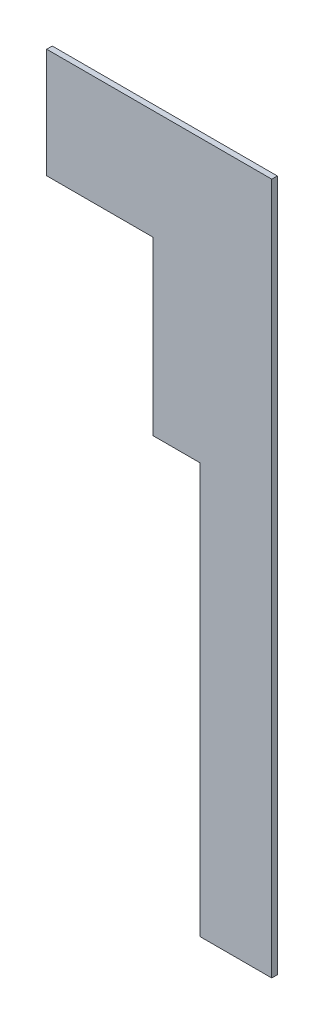
ISO-10303-21;
HEADER;
FILE_DESCRIPTION(('STEP AP214'),'2;1');
FILE_NAME('part.step','',(''),(''),'','','');
FILE_SCHEMA(('AUTOMOTIVE_DESIGN { 1 0 10303 214 1 1 1 1 }'));
ENDSEC;
DATA;
#1=APPLICATION_CONTEXT('core data for automotive mechanical design processes');
#2=APPLICATION_PROTOCOL_DEFINITION('international standard','automotive_design',2000,#1);
#3=PRODUCT_CONTEXT('',#1,'mechanical');
#4=PRODUCT('Part','Part','',(#3));
#5=PRODUCT_RELATED_PRODUCT_CATEGORY('part','',(#4));
#6=PRODUCT_DEFINITION_FORMATION('','',#4);
#7=PRODUCT_DEFINITION_CONTEXT('part definition',#1,'design');
#8=PRODUCT_DEFINITION('design','',#6,#7);
#9=PRODUCT_DEFINITION_SHAPE('','',#8);
#10=(LENGTH_UNIT() NAMED_UNIT(*) SI_UNIT(.MILLI.,.METRE.));
#11=(NAMED_UNIT(*) PLANE_ANGLE_UNIT() SI_UNIT($,.RADIAN.));
#12=(NAMED_UNIT(*) SI_UNIT($,.STERADIAN.) SOLID_ANGLE_UNIT());
#13=UNCERTAINTY_MEASURE_WITH_UNIT(LENGTH_MEASURE(1.E-05),#10,'distance_accuracy_value','');
#14=(GEOMETRIC_REPRESENTATION_CONTEXT(3) GLOBAL_UNCERTAINTY_ASSIGNED_CONTEXT((#13)) GLOBAL_UNIT_ASSIGNED_CONTEXT((#10,
#11,#12)) REPRESENTATION_CONTEXT('',''));
#15=CARTESIAN_POINT('',(0.,0.,0.));
#16=DIRECTION('',(0.,0.,1.));
#17=DIRECTION('',(1.,0.,0.));
#18=AXIS2_PLACEMENT_3D('',#15,#16,#17);
#19=CARTESIAN_POINT('',(0.,0.,-30.));
#20=DIRECTION('',(0.,0.,-1.));
#21=DIRECTION('',(-1.,0.,0.));
#22=AXIS2_PLACEMENT_3D('',#19,#20,#21);
#23=PLANE('',#22);
#24=DIRECTION('',(0.,-1.,0.));
#25=VECTOR('',#24,1.);
#26=CARTESIAN_POINT('',(1372.,1.21372588827547E-13,-30.));
#27=LINE('',#26,#25);
#28=CARTESIAN_POINT('',(1372.,4420.,-30.));
#29=VERTEX_POINT('',#28);
#30=CARTESIAN_POINT('',(1372.,3495.,-30.));
#31=VERTEX_POINT('',#30);
#32=EDGE_CURVE('E107',#29,#31,#27,.T.);
#33=ORIENTED_EDGE('',*,*,#32,.F.);
#34=DIRECTION('',(-1.,0.,0.));
#35=VECTOR('',#34,1.);
#36=CARTESIAN_POINT('',(0.,4420.,-30.));
#37=LINE('',#36,#35);
#38=CARTESIAN_POINT('',(800.,4420.,-30.));
#39=VERTEX_POINT('',#38);
#40=EDGE_CURVE('E110',#29,#39,#37,.T.);
#41=ORIENTED_EDGE('',*,*,#40,.T.);
#42=DIRECTION('',(0.,1.,0.));
#43=VECTOR('',#42,1.);
#44=CARTESIAN_POINT('',(800.,1465.84471612931,-30.));
#45=LINE('',#44,#43);
#46=CARTESIAN_POINT('',(800.,5010.,-30.));
#47=VERTEX_POINT('',#46);
#48=EDGE_CURVE('E154',#39,#47,#45,.T.);
#49=ORIENTED_EDGE('',*,*,#48,.T.);
#50=DIRECTION('',(1.,0.,0.));
#51=VECTOR('',#50,1.);
#52=CARTESIAN_POINT('',(520.,5010.,-30.));
#53=LINE('',#52,#51);
#54=CARTESIAN_POINT('',(2011.,5010.,-30.));
#55=VERTEX_POINT('',#54);
#56=EDGE_CURVE('E159',#47,#55,#53,.T.);
#57=ORIENTED_EDGE('',*,*,#56,.T.);
#58=DIRECTION('',(0.,1.,0.));
#59=VECTOR('',#58,1.);
#60=CARTESIAN_POINT('',(2011.,6025.,-30.));
#61=LINE('',#60,#59);
#62=CARTESIAN_POINT('',(2011.,1287.,-30.));
#63=VERTEX_POINT('',#62);
#64=EDGE_CURVE('E46',#63,#55,#61,.T.);
#65=ORIENTED_EDGE('',*,*,#64,.F.);
#66=DIRECTION('',(-1.,0.,0.));
#67=VECTOR('',#66,1.);
#68=CARTESIAN_POINT('',(2011.,1287.,-30.));
#69=LINE('',#68,#67);
#70=CARTESIAN_POINT('',(1626.,1287.,-30.));
#71=VERTEX_POINT('',#70);
#72=EDGE_CURVE('E128',#63,#71,#69,.T.);
#73=ORIENTED_EDGE('',*,*,#72,.T.);
#74=DIRECTION('',(0.,1.,0.));
#75=VECTOR('',#74,1.);
#76=CARTESIAN_POINT('',(1626.,0.,-30.));
#77=LINE('',#76,#75);
#78=CARTESIAN_POINT('',(1626.,3495.,-30.));
#79=VERTEX_POINT('',#78);
#80=EDGE_CURVE('E139',#71,#79,#77,.T.);
#81=ORIENTED_EDGE('',*,*,#80,.T.);
#82=DIRECTION('',(1.,0.,0.));
#83=VECTOR('',#82,1.);
#84=CARTESIAN_POINT('',(0.,3495.,-30.));
#85=LINE('',#84,#83);
#86=EDGE_CURVE('E113',#31,#79,#85,.T.);
#87=ORIENTED_EDGE('',*,*,#86,.F.);
#88=EDGE_LOOP('',(#33,#41,#49,#57,#65,#73,#81,#87));
#89=FACE_BOUND('',#88,.T.);
#90=ADVANCED_FACE('F38',(#89),#23,.T.);
#91=CARTESIAN_POINT('',(0.,0.,0.));
#92=DIRECTION('',(0.,0.,-1.));
#93=DIRECTION('',(-1.,0.,0.));
#94=AXIS2_PLACEMENT_3D('',#91,#92,#93);
#95=PLANE('',#94);
#96=DIRECTION('',(1.,0.,0.));
#97=VECTOR('',#96,1.);
#98=CARTESIAN_POINT('',(0.,4420.,0.));
#99=LINE('',#98,#97);
#100=CARTESIAN_POINT('',(800.,4420.,0.));
#101=VERTEX_POINT('',#100);
#102=CARTESIAN_POINT('',(1372.,4420.,0.));
#103=VERTEX_POINT('',#102);
#104=EDGE_CURVE('E116',#101,#103,#99,.T.);
#105=ORIENTED_EDGE('',*,*,#104,.T.);
#106=DIRECTION('',(0.,1.,0.));
#107=VECTOR('',#106,1.);
#108=CARTESIAN_POINT('',(1372.,1.21372588827547E-13,0.));
#109=LINE('',#108,#107);
#110=CARTESIAN_POINT('',(1372.,3495.,0.));
#111=VERTEX_POINT('',#110);
#112=EDGE_CURVE('E115',#111,#103,#109,.T.);
#113=ORIENTED_EDGE('',*,*,#112,.F.);
#114=DIRECTION('',(-1.,0.,0.));
#115=VECTOR('',#114,1.);
#116=CARTESIAN_POINT('',(0.,3495.,0.));
#117=LINE('',#116,#115);
#118=CARTESIAN_POINT('',(1626.,3495.,0.));
#119=VERTEX_POINT('',#118);
#120=EDGE_CURVE('E53',#119,#111,#117,.T.);
#121=ORIENTED_EDGE('',*,*,#120,.F.);
#122=DIRECTION('',(0.,-1.,0.));
#123=VECTOR('',#122,1.);
#124=CARTESIAN_POINT('',(1626.,0.,0.));
#125=LINE('',#124,#123);
#126=CARTESIAN_POINT('',(1626.,1287.,0.));
#127=VERTEX_POINT('',#126);
#128=EDGE_CURVE('E11',#119,#127,#125,.T.);
#129=ORIENTED_EDGE('',*,*,#128,.T.);
#130=DIRECTION('',(1.,0.,0.));
#131=VECTOR('',#130,1.);
#132=CARTESIAN_POINT('',(0.,1287.,0.));
#133=LINE('',#132,#131);
#134=CARTESIAN_POINT('',(2011.,1287.,0.));
#135=VERTEX_POINT('',#134);
#136=EDGE_CURVE('E147',#127,#135,#133,.T.);
#137=ORIENTED_EDGE('',*,*,#136,.T.);
#138=DIRECTION('',(0.,1.,0.));
#139=VECTOR('',#138,1.);
#140=CARTESIAN_POINT('',(2011.,6025.,0.));
#141=LINE('',#140,#139);
#142=CARTESIAN_POINT('',(2011.,5010.,0.));
#143=VERTEX_POINT('',#142);
#144=EDGE_CURVE('E61',#135,#143,#141,.T.);
#145=ORIENTED_EDGE('',*,*,#144,.T.);
#146=DIRECTION('',(-1.,0.,0.));
#147=VECTOR('',#146,1.);
#148=CARTESIAN_POINT('',(0.,5010.,0.));
#149=LINE('',#148,#147);
#150=CARTESIAN_POINT('',(800.,5010.,0.));
#151=VERTEX_POINT('',#150);
#152=EDGE_CURVE('E165',#143,#151,#149,.T.);
#153=ORIENTED_EDGE('',*,*,#152,.T.);
#154=DIRECTION('',(0.,-1.,0.));
#155=VECTOR('',#154,1.);
#156=CARTESIAN_POINT('',(800.,0.,0.));
#157=LINE('',#156,#155);
#158=EDGE_CURVE('E156',#151,#101,#157,.T.);
#159=ORIENTED_EDGE('',*,*,#158,.T.);
#160=EDGE_LOOP('',(#105,#113,#121,#129,#137,#145,#153,#159));
#161=FACE_BOUND('',#160,.T.);
#162=ADVANCED_FACE('F175',(#161),#95,.F.);
#163=CARTESIAN_POINT('',(1372.,1.21372588827547E-13,-30.));
#164=DIRECTION('',(-1.,0.,0.));
#165=DIRECTION('',(0.,-1.,0.));
#166=AXIS2_PLACEMENT_3D('',#163,#164,#165);
#167=PLANE('',#166);
#168=ORIENTED_EDGE('',*,*,#32,.T.);
#169=DIRECTION('',(0.,0.,1.));
#170=VECTOR('',#169,1.);
#171=CARTESIAN_POINT('',(1372.,3495.,-30.));
#172=LINE('',#171,#170);
#173=EDGE_CURVE('E138',#31,#111,#172,.T.);
#174=ORIENTED_EDGE('',*,*,#173,.T.);
#175=ORIENTED_EDGE('',*,*,#112,.T.);
#176=DIRECTION('',(0.,0.,1.));
#177=VECTOR('',#176,1.);
#178=CARTESIAN_POINT('',(1372.,4420.,-30.));
#179=LINE('',#178,#177);
#180=EDGE_CURVE('E119',#29,#103,#179,.T.);
#181=ORIENTED_EDGE('',*,*,#180,.F.);
#182=EDGE_LOOP('',(#168,#174,#175,#181));
#183=FACE_BOUND('',#182,.T.);
#184=ADVANCED_FACE('F120',(#183),#167,.T.);
#185=CARTESIAN_POINT('',(800.,2829.,-30.));
#186=DIRECTION('',(1.,0.,0.));
#187=DIRECTION('',(0.,1.,0.));
#188=AXIS2_PLACEMENT_3D('',#185,#186,#187);
#189=PLANE('',#188);
#190=ORIENTED_EDGE('',*,*,#48,.F.);
#191=DIRECTION('',(0.,0.,1.));
#192=VECTOR('',#191,1.);
#193=CARTESIAN_POINT('',(800.,4420.,-30.));
#194=LINE('',#193,#192);
#195=EDGE_CURVE('E124',#39,#101,#194,.T.);
#196=ORIENTED_EDGE('',*,*,#195,.T.);
#197=ORIENTED_EDGE('',*,*,#158,.F.);
#198=DIRECTION('',(0.,0.,1.));
#199=VECTOR('',#198,1.);
#200=CARTESIAN_POINT('',(800.,5010.,-30.));
#201=LINE('',#200,#199);
#202=EDGE_CURVE('E151',#47,#151,#201,.T.);
#203=ORIENTED_EDGE('',*,*,#202,.F.);
#204=EDGE_LOOP('',(#190,#196,#197,#203));
#205=FACE_BOUND('',#204,.T.);
#206=ADVANCED_FACE('F177',(#205),#189,.F.);
#207=CARTESIAN_POINT('',(2011.,6025.,-30.));
#208=DIRECTION('',(1.,0.,0.));
#209=DIRECTION('',(0.,1.,0.));
#210=AXIS2_PLACEMENT_3D('',#207,#208,#209);
#211=PLANE('',#210);
#212=DIRECTION('',(0.,0.,1.));
#213=VECTOR('',#212,1.);
#214=CARTESIAN_POINT('',(2011.,1287.,-30.));
#215=LINE('',#214,#213);
#216=EDGE_CURVE('E131',#63,#135,#215,.T.);
#217=ORIENTED_EDGE('',*,*,#216,.F.);
#218=ORIENTED_EDGE('',*,*,#64,.T.);
#219=DIRECTION('',(0.,0.,1.));
#220=VECTOR('',#219,1.);
#221=CARTESIAN_POINT('',(2011.,5010.,-30.));
#222=LINE('',#221,#220);
#223=EDGE_CURVE('E162',#55,#143,#222,.T.);
#224=ORIENTED_EDGE('',*,*,#223,.T.);
#225=ORIENTED_EDGE('',*,*,#144,.F.);
#226=EDGE_LOOP('',(#217,#218,#224,#225));
#227=FACE_BOUND('',#226,.T.);
#228=ADVANCED_FACE('F40',(#227),#211,.T.);
#229=CARTESIAN_POINT('',(520.,5010.,-30.));
#230=DIRECTION('',(0.,-1.,0.));
#231=DIRECTION('',(0.,0.,-1.));
#232=AXIS2_PLACEMENT_3D('',#229,#230,#231);
#233=PLANE('',#232);
#234=ORIENTED_EDGE('',*,*,#56,.F.);
#235=ORIENTED_EDGE('',*,*,#202,.T.);
#236=ORIENTED_EDGE('',*,*,#152,.F.);
#237=ORIENTED_EDGE('',*,*,#223,.F.);
#238=EDGE_LOOP('',(#234,#235,#236,#237));
#239=FACE_BOUND('',#238,.T.);
#240=ADVANCED_FACE('F174',(#239),#233,.F.);
#241=CARTESIAN_POINT('',(0.,4420.,-30.));
#242=DIRECTION('',(0.,1.,0.));
#243=DIRECTION('',(0.,0.,1.));
#244=AXIS2_PLACEMENT_3D('',#241,#242,#243);
#245=PLANE('',#244);
#246=ORIENTED_EDGE('',*,*,#195,.F.);
#247=ORIENTED_EDGE('',*,*,#40,.F.);
#248=ORIENTED_EDGE('',*,*,#180,.T.);
#249=ORIENTED_EDGE('',*,*,#104,.F.);
#250=EDGE_LOOP('',(#246,#247,#248,#249));
#251=FACE_BOUND('',#250,.T.);
#252=ADVANCED_FACE('F126',(#251),#245,.F.);
#253=CARTESIAN_POINT('',(1626.,0.,-30.));
#254=DIRECTION('',(1.,0.,0.));
#255=DIRECTION('',(0.,0.,-1.));
#256=AXIS2_PLACEMENT_3D('',#253,#254,#255);
#257=PLANE('',#256);
#258=DIRECTION('',(0.,0.,1.));
#259=VECTOR('',#258,1.);
#260=CARTESIAN_POINT('',(1626.,3495.,-30.));
#261=LINE('',#260,#259);
#262=EDGE_CURVE('E141',#79,#119,#261,.T.);
#263=ORIENTED_EDGE('',*,*,#262,.F.);
#264=ORIENTED_EDGE('',*,*,#80,.F.);
#265=DIRECTION('',(0.,0.,1.));
#266=VECTOR('',#265,1.);
#267=CARTESIAN_POINT('',(1626.,1287.,-30.));
#268=LINE('',#267,#266);
#269=EDGE_CURVE('E135',#71,#127,#268,.T.);
#270=ORIENTED_EDGE('',*,*,#269,.T.);
#271=ORIENTED_EDGE('',*,*,#128,.F.);
#272=EDGE_LOOP('',(#263,#264,#270,#271));
#273=FACE_BOUND('',#272,.T.);
#274=ADVANCED_FACE('F195',(#273),#257,.F.);
#275=CARTESIAN_POINT('',(2011.,1287.,-30.));
#276=DIRECTION('',(0.,1.,0.));
#277=DIRECTION('',(0.,0.,1.));
#278=AXIS2_PLACEMENT_3D('',#275,#276,#277);
#279=PLANE('',#278);
#280=ORIENTED_EDGE('',*,*,#269,.F.);
#281=ORIENTED_EDGE('',*,*,#72,.F.);
#282=ORIENTED_EDGE('',*,*,#216,.T.);
#283=ORIENTED_EDGE('',*,*,#136,.F.);
#284=EDGE_LOOP('',(#280,#281,#282,#283));
#285=FACE_BOUND('',#284,.T.);
#286=ADVANCED_FACE('F200',(#285),#279,.F.);
#287=CARTESIAN_POINT('',(0.,3495.,-30.));
#288=DIRECTION('',(0.,-1.,0.));
#289=DIRECTION('',(0.,0.,-1.));
#290=AXIS2_PLACEMENT_3D('',#287,#288,#289);
#291=PLANE('',#290);
#292=ORIENTED_EDGE('',*,*,#120,.T.);
#293=ORIENTED_EDGE('',*,*,#173,.F.);
#294=ORIENTED_EDGE('',*,*,#86,.T.);
#295=ORIENTED_EDGE('',*,*,#262,.T.);
#296=EDGE_LOOP('',(#292,#293,#294,#295));
#297=FACE_BOUND('',#296,.T.);
#298=ADVANCED_FACE('F205',(#297),#291,.T.);
#299=CLOSED_SHELL('',(#90,#162,#184,#206,#228,#240,#252,#274,#286,#298));
#300=MANIFOLD_SOLID_BREP('B2',#299);
#301=ADVANCED_BREP_SHAPE_REPRESENTATION('',(#18,#300),#14);
#302=SHAPE_DEFINITION_REPRESENTATION(#9,#301);
ENDSEC;
END-ISO-10303-21;
